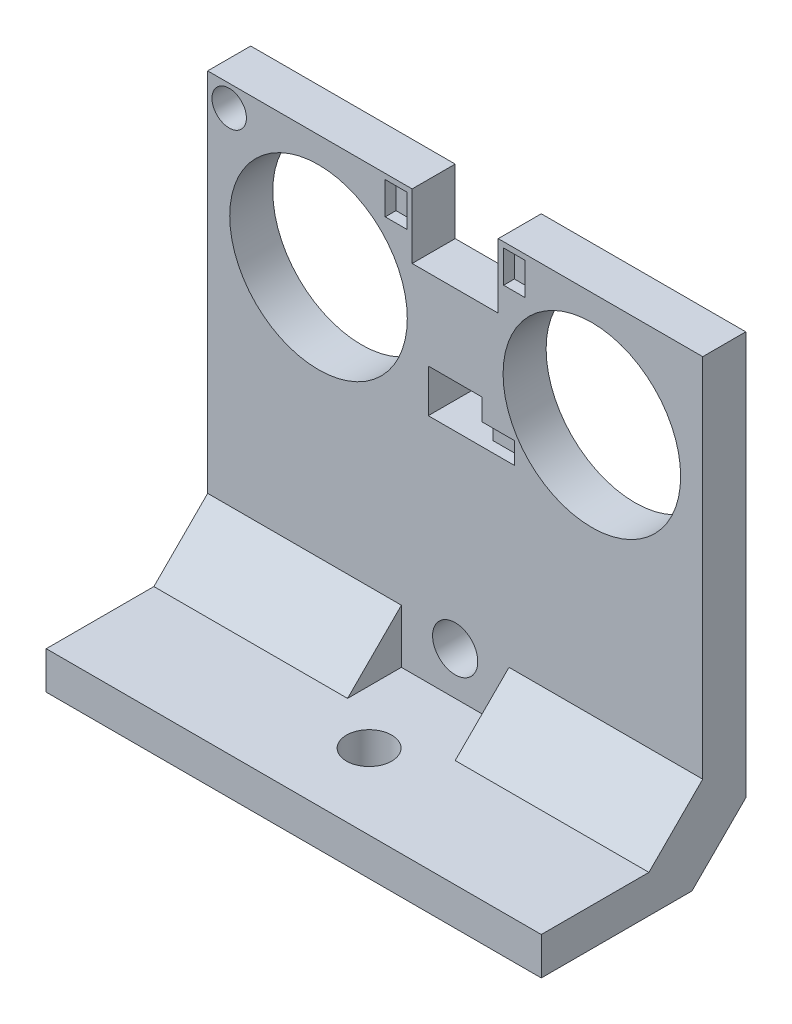
ISO-10303-21;
HEADER;
FILE_DESCRIPTION(('STEP AP214'),'2;1');
FILE_NAME('part.step','',(''),(''),'','','');
FILE_SCHEMA(('AUTOMOTIVE_DESIGN { 1 0 10303 214 1 1 1 1 }'));
ENDSEC;
DATA;
#1=APPLICATION_CONTEXT('core data for automotive mechanical design processes');
#2=APPLICATION_PROTOCOL_DEFINITION('international standard','automotive_design',2000,#1);
#3=PRODUCT_CONTEXT('',#1,'mechanical');
#4=PRODUCT('Part','Part','',(#3));
#5=PRODUCT_RELATED_PRODUCT_CATEGORY('part','',(#4));
#6=PRODUCT_DEFINITION_FORMATION('','',#4);
#7=PRODUCT_DEFINITION_CONTEXT('part definition',#1,'design');
#8=PRODUCT_DEFINITION('design','',#6,#7);
#9=PRODUCT_DEFINITION_SHAPE('','',#8);
#10=(LENGTH_UNIT() NAMED_UNIT(*) SI_UNIT(.MILLI.,.METRE.));
#11=(NAMED_UNIT(*) PLANE_ANGLE_UNIT() SI_UNIT($,.RADIAN.));
#12=(NAMED_UNIT(*) SI_UNIT($,.STERADIAN.) SOLID_ANGLE_UNIT());
#13=UNCERTAINTY_MEASURE_WITH_UNIT(LENGTH_MEASURE(1.E-05),#10,'distance_accuracy_value','');
#14=(GEOMETRIC_REPRESENTATION_CONTEXT(3) GLOBAL_UNCERTAINTY_ASSIGNED_CONTEXT((#13)) GLOBAL_UNIT_ASSIGNED_CONTEXT((#10,
#11,#12)) REPRESENTATION_CONTEXT('',''));
#15=CARTESIAN_POINT('',(0.,0.,0.));
#16=DIRECTION('',(0.,0.,1.));
#17=DIRECTION('',(1.,0.,0.));
#18=AXIS2_PLACEMENT_3D('',#15,#16,#17);
#19=CARTESIAN_POINT('',(23.,-29.,9.00000000000004));
#20=DIRECTION('',(0.,-0.707106781186552,-0.707106781186544));
#21=DIRECTION('',(-1.,0.,0.));
#22=AXIS2_PLACEMENT_3D('',#19,#20,#21);
#23=PLANE('',#22);
#24=DIRECTION('',(0.,0.707106781186544,-0.707106781186551));
#25=VECTOR('',#24,1.);
#26=CARTESIAN_POINT('',(5.,-29.,9.00000000000004));
#27=LINE('',#26,#25);
#28=CARTESIAN_POINT('',(5.,-29.,9.00000000000004));
#29=VERTEX_POINT('',#28);
#30=CARTESIAN_POINT('',(5.,-24.,4.));
#31=VERTEX_POINT('',#30);
#32=EDGE_CURVE('E12',#29,#31,#27,.T.);
#33=ORIENTED_EDGE('',*,*,#32,.F.);
#34=DIRECTION('',(-1.,0.,0.));
#35=VECTOR('',#34,1.);
#36=CARTESIAN_POINT('',(23.,-29.,9.00000000000004));
#37=LINE('',#36,#35);
#38=CARTESIAN_POINT('',(23.,-29.,9.00000000000004));
#39=VERTEX_POINT('',#38);
#40=EDGE_CURVE('E483',#39,#29,#37,.T.);
#41=ORIENTED_EDGE('',*,*,#40,.F.);
#42=DIRECTION('',(0.,-0.707106781186544,0.707106781186551));
#43=VECTOR('',#42,1.);
#44=CARTESIAN_POINT('',(23.,-17.0000000000001,-3.00000000000001));
#45=LINE('',#44,#43);
#46=CARTESIAN_POINT('',(23.,-24.,4.));
#47=VERTEX_POINT('',#46);
#48=EDGE_CURVE('E488',#47,#39,#45,.T.);
#49=ORIENTED_EDGE('',*,*,#48,.F.);
#50=DIRECTION('',(1.,0.,0.));
#51=VECTOR('',#50,1.);
#52=CARTESIAN_POINT('',(0.,-24.,4.));
#53=LINE('',#52,#51);
#54=EDGE_CURVE('E485',#31,#47,#53,.T.);
#55=ORIENTED_EDGE('',*,*,#54,.F.);
#56=EDGE_LOOP('',(#33,#41,#49,#55));
#57=FACE_BOUND('',#56,.T.);
#58=ADVANCED_FACE('F36',(#57),#23,.F.);
#59=DIRECTION('',(0.,-0.707106781186544,0.707106781186551));
#60=VECTOR('',#59,1.);
#61=CARTESIAN_POINT('',(-5.,-29.,9.00000000000004));
#62=LINE('',#61,#60);
#63=CARTESIAN_POINT('',(-5.,-24.,4.));
#64=VERTEX_POINT('',#63);
#65=CARTESIAN_POINT('',(-5.,-29.,9.00000000000004));
#66=VERTEX_POINT('',#65);
#67=EDGE_CURVE('E44',#64,#66,#62,.T.);
#68=ORIENTED_EDGE('',*,*,#67,.F.);
#69=CARTESIAN_POINT('',(-23.,-24.,4.));
#70=VERTEX_POINT('',#69);
#71=EDGE_CURVE('E251',#70,#64,#53,.T.);
#72=ORIENTED_EDGE('',*,*,#71,.F.);
#73=DIRECTION('',(0.,0.707106781186544,-0.707106781186551));
#74=VECTOR('',#73,1.);
#75=CARTESIAN_POINT('',(-23.,-17.0000000000001,-3.00000000000001));
#76=LINE('',#75,#74);
#77=CARTESIAN_POINT('',(-23.,-29.,9.00000000000004));
#78=VERTEX_POINT('',#77);
#79=EDGE_CURVE('E51',#78,#70,#76,.T.);
#80=ORIENTED_EDGE('',*,*,#79,.F.);
#81=EDGE_CURVE('E59',#66,#78,#37,.T.);
#82=ORIENTED_EDGE('',*,*,#81,.F.);
#83=EDGE_LOOP('',(#68,#72,#80,#82));
#84=FACE_BOUND('',#83,.T.);
#85=ADVANCED_FACE('F523',(#84),#23,.F.);
#86=CARTESIAN_POINT('',(0.,-25.,19.));
#87=DIRECTION('',(0.,0.,-1.));
#88=DIRECTION('',(-1.,0.,0.));
#89=AXIS2_PLACEMENT_3D('',#86,#87,#88);
#90=CYLINDRICAL_SURFACE('',#89,2.1);
#91=CARTESIAN_POINT('',(0.,-25.,0.));
#92=DIRECTION('',(0.,0.,-1.));
#93=DIRECTION('',(-1.,0.,0.));
#94=AXIS2_PLACEMENT_3D('',#91,#92,#93);
#95=CIRCLE('',#94,2.1);
#96=CARTESIAN_POINT('',(-2.1,-25.,0.));
#97=VERTEX_POINT('',#96);
#98=EDGE_CURVE('E239',#97,#97,#95,.T.);
#99=ORIENTED_EDGE('',*,*,#98,.T.);
#100=EDGE_LOOP('',(#99));
#101=FACE_BOUND('',#100,.T.);
#102=CARTESIAN_POINT('',(0.,-25.,4.));
#103=DIRECTION('',(0.,0.,-1.));
#104=DIRECTION('',(-1.,0.,0.));
#105=AXIS2_PLACEMENT_3D('',#102,#103,#104);
#106=CIRCLE('',#105,2.1);
#107=CARTESIAN_POINT('',(-2.1,-25.,4.));
#108=VERTEX_POINT('',#107);
#109=EDGE_CURVE('E263',#108,#108,#106,.T.);
#110=ORIENTED_EDGE('',*,*,#109,.F.);
#111=EDGE_LOOP('',(#110));
#112=FACE_BOUND('',#111,.T.);
#113=ADVANCED_FACE('F514',(#101,#112),#90,.F.);
#114=CARTESIAN_POINT('',(0.,0.,4.));
#115=DIRECTION('',(0.,0.,-1.));
#116=DIRECTION('',(-1.,0.,0.));
#117=AXIS2_PLACEMENT_3D('',#114,#115,#116);
#118=PLANE('',#117);
#119=CARTESIAN_POINT('',(-21.,8.,4.));
#120=DIRECTION('',(0.,0.,1.));
#121=DIRECTION('',(1.,0.,0.));
#122=AXIS2_PLACEMENT_3D('',#119,#120,#121);
#123=CIRCLE('',#122,1.6);
#124=CARTESIAN_POINT('',(-19.4,8.,4.));
#125=VERTEX_POINT('',#124);
#126=EDGE_CURVE('E505',#125,#125,#123,.T.);
#127=ORIENTED_EDGE('',*,*,#126,.F.);
#128=EDGE_LOOP('',(#127));
#129=FACE_BOUND('',#128,.T.);
#130=DIRECTION('',(0.,1.,0.));
#131=VECTOR('',#130,1.);
#132=CARTESIAN_POINT('',(5.,-21.,4.));
#133=LINE('',#132,#131);
#134=CARTESIAN_POINT('',(5.,-29.,4.));
#135=VERTEX_POINT('',#134);
#136=EDGE_CURVE('E252',#135,#31,#133,.T.);
#137=ORIENTED_EDGE('',*,*,#136,.T.);
#138=ORIENTED_EDGE('',*,*,#54,.T.);
#139=DIRECTION('',(0.,1.,0.));
#140=VECTOR('',#139,1.);
#141=CARTESIAN_POINT('',(23.,-10.,4.));
#142=LINE('',#141,#140);
#143=CARTESIAN_POINT('',(23.,10.,4.));
#144=VERTEX_POINT('',#143);
#145=EDGE_CURVE('E452',#47,#144,#142,.T.);
#146=ORIENTED_EDGE('',*,*,#145,.T.);
#147=DIRECTION('',(-1.,0.,0.));
#148=VECTOR('',#147,1.);
#149=CARTESIAN_POINT('',(-23.,10.,4.));
#150=LINE('',#149,#148);
#151=CARTESIAN_POINT('',(4.00000000000001,10.,4.));
#152=VERTEX_POINT('',#151);
#153=EDGE_CURVE('E456',#144,#152,#150,.T.);
#154=ORIENTED_EDGE('',*,*,#153,.T.);
#155=DIRECTION('',(0.,1.,0.));
#156=VECTOR('',#155,1.);
#157=CARTESIAN_POINT('',(4.00000000000001,4.,4.));
#158=LINE('',#157,#156);
#159=CARTESIAN_POINT('',(4.00000000000001,4.,4.));
#160=VERTEX_POINT('',#159);
#161=EDGE_CURVE('E407',#160,#152,#158,.T.);
#162=ORIENTED_EDGE('',*,*,#161,.F.);
#163=DIRECTION('',(1.,0.,0.));
#164=VECTOR('',#163,1.);
#165=CARTESIAN_POINT('',(-3.99999999999999,4.,4.));
#166=LINE('',#165,#164);
#167=CARTESIAN_POINT('',(-3.99999999999999,4.,4.));
#168=VERTEX_POINT('',#167);
#169=EDGE_CURVE('E418',#168,#160,#166,.T.);
#170=ORIENTED_EDGE('',*,*,#169,.F.);
#171=DIRECTION('',(0.,-1.,0.));
#172=VECTOR('',#171,1.);
#173=CARTESIAN_POINT('',(-3.99999999999999,4.,4.));
#174=LINE('',#173,#172);
#175=CARTESIAN_POINT('',(-3.99999999999999,10.,4.));
#176=VERTEX_POINT('',#175);
#177=EDGE_CURVE('E426',#176,#168,#174,.T.);
#178=ORIENTED_EDGE('',*,*,#177,.F.);
#179=CARTESIAN_POINT('',(-23.,10.,4.));
#180=VERTEX_POINT('',#179);
#181=EDGE_CURVE('E454',#176,#180,#150,.T.);
#182=ORIENTED_EDGE('',*,*,#181,.T.);
#183=DIRECTION('',(0.,-1.,0.));
#184=VECTOR('',#183,1.);
#185=CARTESIAN_POINT('',(-23.,-10.,4.));
#186=LINE('',#185,#184);
#187=EDGE_CURVE('E459',#180,#70,#186,.T.);
#188=ORIENTED_EDGE('',*,*,#187,.T.);
#189=ORIENTED_EDGE('',*,*,#71,.T.);
#190=DIRECTION('',(0.,-1.,0.));
#191=VECTOR('',#190,1.);
#192=CARTESIAN_POINT('',(-5.,-21.,4.));
#193=LINE('',#192,#191);
#194=CARTESIAN_POINT('',(-5.,-29.,4.));
#195=VERTEX_POINT('',#194);
#196=EDGE_CURVE('E236',#64,#195,#193,.T.);
#197=ORIENTED_EDGE('',*,*,#196,.T.);
#198=DIRECTION('',(1.,0.,0.));
#199=VECTOR('',#198,1.);
#200=CARTESIAN_POINT('',(-5.,-29.,4.));
#201=LINE('',#200,#199);
#202=EDGE_CURVE('E248',#195,#135,#201,.T.);
#203=ORIENTED_EDGE('',*,*,#202,.T.);
#204=EDGE_LOOP('',(#137,#138,#146,#154,#162,#170,#178,#182,#188,#189,#197,#203));
#205=FACE_BOUND('',#204,.T.);
#206=ORIENTED_EDGE('',*,*,#109,.T.);
#207=EDGE_LOOP('',(#206));
#208=FACE_BOUND('',#207,.T.);
#209=DIRECTION('',(1.,0.,0.));
#210=VECTOR('',#209,1.);
#211=CARTESIAN_POINT('',(-4.5,6.5,4.));
#212=LINE('',#211,#210);
#213=CARTESIAN_POINT('',(-6.5,6.5,4.));
#214=VERTEX_POINT('',#213);
#215=CARTESIAN_POINT('',(-4.5,6.5,4.));
#216=VERTEX_POINT('',#215);
#217=EDGE_CURVE('E336',#214,#216,#212,.T.);
#218=ORIENTED_EDGE('',*,*,#217,.F.);
#219=DIRECTION('',(0.,-1.,0.));
#220=VECTOR('',#219,1.);
#221=CARTESIAN_POINT('',(-6.5,9.5,4.));
#222=LINE('',#221,#220);
#223=CARTESIAN_POINT('',(-6.5,9.5,4.));
#224=VERTEX_POINT('',#223);
#225=EDGE_CURVE('E334',#224,#214,#222,.T.);
#226=ORIENTED_EDGE('',*,*,#225,.F.);
#227=DIRECTION('',(-1.,0.,0.));
#228=VECTOR('',#227,1.);
#229=CARTESIAN_POINT('',(-4.5,9.5,4.));
#230=LINE('',#229,#228);
#231=CARTESIAN_POINT('',(-4.5,9.5,4.));
#232=VERTEX_POINT('',#231);
#233=EDGE_CURVE('E324',#232,#224,#230,.T.);
#234=ORIENTED_EDGE('',*,*,#233,.F.);
#235=DIRECTION('',(0.,1.,0.));
#236=VECTOR('',#235,1.);
#237=CARTESIAN_POINT('',(-4.5,9.5,4.));
#238=LINE('',#237,#236);
#239=EDGE_CURVE('E340',#216,#232,#238,.T.);
#240=ORIENTED_EDGE('',*,*,#239,.F.);
#241=EDGE_LOOP('',(#218,#226,#234,#240));
#242=FACE_BOUND('',#241,.T.);
#243=DIRECTION('',(1.,0.,0.));
#244=VECTOR('',#243,1.);
#245=CARTESIAN_POINT('',(6.50000000000001,6.5,4.));
#246=LINE('',#245,#244);
#247=CARTESIAN_POINT('',(4.50000000000001,6.5,4.));
#248=VERTEX_POINT('',#247);
#249=CARTESIAN_POINT('',(6.50000000000001,6.5,4.));
#250=VERTEX_POINT('',#249);
#251=EDGE_CURVE('E367',#248,#250,#246,.T.);
#252=ORIENTED_EDGE('',*,*,#251,.F.);
#253=DIRECTION('',(0.,-1.,0.));
#254=VECTOR('',#253,1.);
#255=CARTESIAN_POINT('',(4.50000000000001,9.5,4.));
#256=LINE('',#255,#254);
#257=CARTESIAN_POINT('',(4.50000000000001,9.5,4.));
#258=VERTEX_POINT('',#257);
#259=EDGE_CURVE('E293',#258,#248,#256,.T.);
#260=ORIENTED_EDGE('',*,*,#259,.F.);
#261=DIRECTION('',(-1.,0.,0.));
#262=VECTOR('',#261,1.);
#263=CARTESIAN_POINT('',(6.50000000000001,9.5,4.));
#264=LINE('',#263,#262);
#265=CARTESIAN_POINT('',(6.50000000000001,9.5,4.));
#266=VERTEX_POINT('',#265);
#267=EDGE_CURVE('E356',#266,#258,#264,.T.);
#268=ORIENTED_EDGE('',*,*,#267,.F.);
#269=DIRECTION('',(0.,1.,0.));
#270=VECTOR('',#269,1.);
#271=CARTESIAN_POINT('',(6.50000000000001,9.5,4.));
#272=LINE('',#271,#270);
#273=EDGE_CURVE('E370',#250,#266,#272,.T.);
#274=ORIENTED_EDGE('',*,*,#273,.F.);
#275=EDGE_LOOP('',(#252,#260,#268,#274));
#276=FACE_BOUND('',#275,.T.);
#277=DIRECTION('',(0.,1.,0.));
#278=VECTOR('',#277,1.);
#279=CARTESIAN_POINT('',(2.5,-3.5,4.));
#280=LINE('',#279,#278);
#281=CARTESIAN_POINT('',(2.5,-5.5,4.));
#282=VERTEX_POINT('',#281);
#283=CARTESIAN_POINT('',(2.5,-3.5,4.));
#284=VERTEX_POINT('',#283);
#285=EDGE_CURVE('E315',#282,#284,#280,.T.);
#286=ORIENTED_EDGE('',*,*,#285,.F.);
#287=DIRECTION('',(-1.,0.,0.));
#288=VECTOR('',#287,1.);
#289=CARTESIAN_POINT('',(2.5,-5.5,4.));
#290=LINE('',#289,#288);
#291=CARTESIAN_POINT('',(5.5,-5.5,4.));
#292=VERTEX_POINT('',#291);
#293=EDGE_CURVE('E297',#292,#282,#290,.T.);
#294=ORIENTED_EDGE('',*,*,#293,.F.);
#295=DIRECTION('',(0.,1.,0.));
#296=VECTOR('',#295,1.);
#297=CARTESIAN_POINT('',(5.5,-7.5,4.));
#298=LINE('',#297,#296);
#299=CARTESIAN_POINT('',(5.5,-7.5,4.));
#300=VERTEX_POINT('',#299);
#301=EDGE_CURVE('E307',#300,#292,#298,.T.);
#302=ORIENTED_EDGE('',*,*,#301,.F.);
#303=DIRECTION('',(1.,0.,0.));
#304=VECTOR('',#303,1.);
#305=CARTESIAN_POINT('',(-2.5,-7.5,4.));
#306=LINE('',#305,#304);
#307=CARTESIAN_POINT('',(-2.5,-7.5,4.));
#308=VERTEX_POINT('',#307);
#309=EDGE_CURVE('E386',#308,#300,#306,.T.);
#310=ORIENTED_EDGE('',*,*,#309,.F.);
#311=DIRECTION('',(0.,-1.,0.));
#312=VECTOR('',#311,1.);
#313=CARTESIAN_POINT('',(-2.5,-3.5,4.));
#314=LINE('',#313,#312);
#315=CARTESIAN_POINT('',(-2.5,-3.5,4.));
#316=VERTEX_POINT('',#315);
#317=EDGE_CURVE('E400',#316,#308,#314,.T.);
#318=ORIENTED_EDGE('',*,*,#317,.F.);
#319=DIRECTION('',(-1.,0.,0.));
#320=VECTOR('',#319,1.);
#321=CARTESIAN_POINT('',(-2.5,-3.5,4.));
#322=LINE('',#321,#320);
#323=EDGE_CURVE('E397',#284,#316,#322,.T.);
#324=ORIENTED_EDGE('',*,*,#323,.F.);
#325=EDGE_LOOP('',(#286,#294,#302,#310,#318,#324));
#326=FACE_BOUND('',#325,.T.);
#327=CARTESIAN_POINT('',(-12.7,-0.650000000000001,4.));
#328=DIRECTION('',(0.,0.,1.));
#329=DIRECTION('',(1.,0.,0.));
#330=AXIS2_PLACEMENT_3D('',#327,#328,#329);
#331=CIRCLE('',#330,8.25);
#332=CARTESIAN_POINT('',(-4.45,-0.650000000000001,4.));
#333=VERTEX_POINT('',#332);
#334=EDGE_CURVE('E444',#333,#333,#331,.T.);
#335=ORIENTED_EDGE('',*,*,#334,.F.);
#336=EDGE_LOOP('',(#335));
#337=FACE_BOUND('',#336,.T.);
#338=CARTESIAN_POINT('',(12.7,-0.650000000000001,4.));
#339=DIRECTION('',(0.,0.,1.));
#340=DIRECTION('',(1.,0.,0.));
#341=AXIS2_PLACEMENT_3D('',#338,#339,#340);
#342=CIRCLE('',#341,8.25);
#343=CARTESIAN_POINT('',(20.95,-0.650000000000001,4.));
#344=VERTEX_POINT('',#343);
#345=EDGE_CURVE('E433',#344,#344,#342,.T.);
#346=ORIENTED_EDGE('',*,*,#345,.F.);
#347=EDGE_LOOP('',(#346));
#348=FACE_BOUND('',#347,.T.);
#349=ADVANCED_FACE('F246',(#129,#205,#208,#242,#276,#326,#337,#348),#118,.F.);
#350=CARTESIAN_POINT('',(-23.,10.,4.));
#351=DIRECTION('',(0.,-1.,0.));
#352=DIRECTION('',(0.,0.,-1.));
#353=AXIS2_PLACEMENT_3D('',#350,#351,#352);
#354=PLANE('',#353);
#355=DIRECTION('',(-1.,0.,0.));
#356=VECTOR('',#355,1.);
#357=CARTESIAN_POINT('',(-23.,10.,0.));
#358=LINE('',#357,#356);
#359=CARTESIAN_POINT('',(23.,10.,0.));
#360=VERTEX_POINT('',#359);
#361=CARTESIAN_POINT('',(4.00000000000001,10.,0.));
#362=VERTEX_POINT('',#361);
#363=EDGE_CURVE('E464',#360,#362,#358,.T.);
#364=ORIENTED_EDGE('',*,*,#363,.T.);
#365=DIRECTION('',(0.,0.,1.));
#366=VECTOR('',#365,1.);
#367=CARTESIAN_POINT('',(4.00000000000001,10.,0.));
#368=LINE('',#367,#366);
#369=EDGE_CURVE('E424',#362,#152,#368,.T.);
#370=ORIENTED_EDGE('',*,*,#369,.T.);
#371=ORIENTED_EDGE('',*,*,#153,.F.);
#372=DIRECTION('',(0.,0.,-1.));
#373=VECTOR('',#372,1.);
#374=CARTESIAN_POINT('',(23.,10.,4.));
#375=LINE('',#374,#373);
#376=EDGE_CURVE('E471',#144,#360,#375,.T.);
#377=ORIENTED_EDGE('',*,*,#376,.T.);
#378=EDGE_LOOP('',(#364,#370,#371,#377));
#379=FACE_BOUND('',#378,.T.);
#380=ADVANCED_FACE('F513',(#379),#354,.F.);
#381=CARTESIAN_POINT('',(23.,-10.,4.));
#382=DIRECTION('',(-1.,0.,0.));
#383=DIRECTION('',(0.,0.,1.));
#384=AXIS2_PLACEMENT_3D('',#381,#382,#383);
#385=PLANE('',#384);
#386=DIRECTION('',(0.,0.,1.));
#387=VECTOR('',#386,1.);
#388=CARTESIAN_POINT('',(23.,-32.5,4.));
#389=LINE('',#388,#387);
#390=CARTESIAN_POINT('',(23.,-32.5,5.));
#391=VERTEX_POINT('',#390);
#392=CARTESIAN_POINT('',(23.,-32.5,19.));
#393=VERTEX_POINT('',#392);
#394=EDGE_CURVE('E291',#391,#393,#389,.T.);
#395=ORIENTED_EDGE('',*,*,#394,.F.);
#396=DIRECTION('',(0.,-0.707106781186549,0.707106781186546));
#397=VECTOR('',#396,1.);
#398=CARTESIAN_POINT('',(23.,-32.5,5.));
#399=LINE('',#398,#397);
#400=CARTESIAN_POINT('',(23.,-27.5,0.));
#401=VERTEX_POINT('',#400);
#402=EDGE_CURVE('E477',#391,#401,#399,.F.);
#403=ORIENTED_EDGE('',*,*,#402,.T.);
#404=DIRECTION('',(0.,1.,0.));
#405=VECTOR('',#404,1.);
#406=CARTESIAN_POINT('',(23.,-10.,0.));
#407=LINE('',#406,#405);
#408=EDGE_CURVE('E443',#401,#360,#407,.T.);
#409=ORIENTED_EDGE('',*,*,#408,.T.);
#410=ORIENTED_EDGE('',*,*,#376,.F.);
#411=ORIENTED_EDGE('',*,*,#145,.F.);
#412=ORIENTED_EDGE('',*,*,#48,.T.);
#413=DIRECTION('',(0.,0.,-1.));
#414=VECTOR('',#413,1.);
#415=CARTESIAN_POINT('',(23.,-29.,19.));
#416=LINE('',#415,#414);
#417=CARTESIAN_POINT('',(23.,-29.,19.));
#418=VERTEX_POINT('',#417);
#419=EDGE_CURVE('E276',#418,#39,#416,.T.);
#420=ORIENTED_EDGE('',*,*,#419,.F.);
#421=DIRECTION('',(0.,1.,0.));
#422=VECTOR('',#421,1.);
#423=CARTESIAN_POINT('',(23.,-32.5,19.));
#424=LINE('',#423,#422);
#425=EDGE_CURVE('E273',#393,#418,#424,.T.);
#426=ORIENTED_EDGE('',*,*,#425,.F.);
#427=EDGE_LOOP('',(#395,#403,#409,#410,#411,#412,#420,#426));
#428=FACE_BOUND('',#427,.T.);
#429=ADVANCED_FACE('F495',(#428),#385,.F.);
#430=ORIENTED_EDGE('',*,*,#181,.F.);
#431=DIRECTION('',(0.,0.,1.));
#432=VECTOR('',#431,1.);
#433=CARTESIAN_POINT('',(-3.99999999999999,10.,0.));
#434=LINE('',#433,#432);
#435=CARTESIAN_POINT('',(-3.99999999999999,10.,0.));
#436=VERTEX_POINT('',#435);
#437=EDGE_CURVE('E436',#436,#176,#434,.T.);
#438=ORIENTED_EDGE('',*,*,#437,.F.);
#439=CARTESIAN_POINT('',(-23.,10.,0.));
#440=VERTEX_POINT('',#439);
#441=EDGE_CURVE('E463',#436,#440,#358,.T.);
#442=ORIENTED_EDGE('',*,*,#441,.T.);
#443=DIRECTION('',(0.,0.,-1.));
#444=VECTOR('',#443,1.);
#445=CARTESIAN_POINT('',(-23.,10.,4.));
#446=LINE('',#445,#444);
#447=EDGE_CURVE('E461',#180,#440,#446,.T.);
#448=ORIENTED_EDGE('',*,*,#447,.F.);
#449=EDGE_LOOP('',(#430,#438,#442,#448));
#450=FACE_BOUND('',#449,.T.);
#451=ADVANCED_FACE('F522',(#450),#354,.F.);
#452=CARTESIAN_POINT('',(-23.,-10.,4.));
#453=DIRECTION('',(1.,0.,0.));
#454=DIRECTION('',(0.,0.,-1.));
#455=AXIS2_PLACEMENT_3D('',#452,#453,#454);
#456=PLANE('',#455);
#457=DIRECTION('',(0.,-1.,0.));
#458=VECTOR('',#457,1.);
#459=CARTESIAN_POINT('',(-23.,-10.,0.));
#460=LINE('',#459,#458);
#461=CARTESIAN_POINT('',(-23.,-27.5,0.));
#462=VERTEX_POINT('',#461);
#463=EDGE_CURVE('E455',#440,#462,#460,.T.);
#464=ORIENTED_EDGE('',*,*,#463,.T.);
#465=DIRECTION('',(0.,0.707106781186549,-0.707106781186546));
#466=VECTOR('',#465,1.);
#467=CARTESIAN_POINT('',(-23.,-32.5,5.));
#468=LINE('',#467,#466);
#469=CARTESIAN_POINT('',(-23.,-32.5,5.));
#470=VERTEX_POINT('',#469);
#471=EDGE_CURVE('E481',#462,#470,#468,.F.);
#472=ORIENTED_EDGE('',*,*,#471,.T.);
#473=DIRECTION('',(0.,0.,-1.));
#474=VECTOR('',#473,1.);
#475=CARTESIAN_POINT('',(-23.,-32.5,4.));
#476=LINE('',#475,#474);
#477=CARTESIAN_POINT('',(-23.,-32.5,19.));
#478=VERTEX_POINT('',#477);
#479=EDGE_CURVE('E286',#478,#470,#476,.T.);
#480=ORIENTED_EDGE('',*,*,#479,.F.);
#481=DIRECTION('',(0.,1.,0.));
#482=VECTOR('',#481,1.);
#483=CARTESIAN_POINT('',(-23.,-32.5,19.));
#484=LINE('',#483,#482);
#485=CARTESIAN_POINT('',(-23.,-29.,19.));
#486=VERTEX_POINT('',#485);
#487=EDGE_CURVE('E270',#478,#486,#484,.T.);
#488=ORIENTED_EDGE('',*,*,#487,.T.);
#489=DIRECTION('',(0.,0.,-1.));
#490=VECTOR('',#489,1.);
#491=CARTESIAN_POINT('',(-23.,-29.,19.));
#492=LINE('',#491,#490);
#493=EDGE_CURVE('E277',#486,#78,#492,.T.);
#494=ORIENTED_EDGE('',*,*,#493,.T.);
#495=ORIENTED_EDGE('',*,*,#79,.T.);
#496=ORIENTED_EDGE('',*,*,#187,.F.);
#497=ORIENTED_EDGE('',*,*,#447,.T.);
#498=EDGE_LOOP('',(#464,#472,#480,#488,#494,#495,#496,#497));
#499=FACE_BOUND('',#498,.T.);
#500=ADVANCED_FACE('F535',(#499),#456,.F.);
#501=CARTESIAN_POINT('',(0.,0.,0.));
#502=DIRECTION('',(0.,0.,-1.));
#503=DIRECTION('',(-1.,0.,0.));
#504=AXIS2_PLACEMENT_3D('',#501,#502,#503);
#505=PLANE('',#504);
#506=CARTESIAN_POINT('',(-21.,8.,0.));
#507=DIRECTION('',(0.,0.,-1.));
#508=DIRECTION('',(-1.,0.,0.));
#509=AXIS2_PLACEMENT_3D('',#506,#507,#508);
#510=CIRCLE('',#509,1.6);
#511=CARTESIAN_POINT('',(-22.6,8.,0.));
#512=VERTEX_POINT('',#511);
#513=EDGE_CURVE('E39',#512,#512,#510,.T.);
#514=ORIENTED_EDGE('',*,*,#513,.F.);
#515=EDGE_LOOP('',(#514));
#516=FACE_BOUND('',#515,.T.);
#517=ORIENTED_EDGE('',*,*,#98,.F.);
#518=EDGE_LOOP('',(#517));
#519=FACE_BOUND('',#518,.T.);
#520=DIRECTION('',(0.,1.,0.));
#521=VECTOR('',#520,1.);
#522=CARTESIAN_POINT('',(2.5,-3.5,0.));
#523=LINE('',#522,#521);
#524=CARTESIAN_POINT('',(2.5,-7.5,0.));
#525=VERTEX_POINT('',#524);
#526=CARTESIAN_POINT('',(2.5,-3.5,0.));
#527=VERTEX_POINT('',#526);
#528=EDGE_CURVE('E382',#525,#527,#523,.T.);
#529=ORIENTED_EDGE('',*,*,#528,.T.);
#530=DIRECTION('',(-1.,0.,0.));
#531=VECTOR('',#530,1.);
#532=CARTESIAN_POINT('',(-2.5,-3.5,0.));
#533=LINE('',#532,#531);
#534=CARTESIAN_POINT('',(-2.5,-3.5,0.));
#535=VERTEX_POINT('',#534);
#536=EDGE_CURVE('E385',#527,#535,#533,.T.);
#537=ORIENTED_EDGE('',*,*,#536,.T.);
#538=DIRECTION('',(0.,-1.,0.));
#539=VECTOR('',#538,1.);
#540=CARTESIAN_POINT('',(-2.5,-3.5,0.));
#541=LINE('',#540,#539);
#542=CARTESIAN_POINT('',(-2.5,-7.5,0.));
#543=VERTEX_POINT('',#542);
#544=EDGE_CURVE('E389',#535,#543,#541,.T.);
#545=ORIENTED_EDGE('',*,*,#544,.T.);
#546=DIRECTION('',(1.,0.,0.));
#547=VECTOR('',#546,1.);
#548=CARTESIAN_POINT('',(-2.5,-7.5,0.));
#549=LINE('',#548,#547);
#550=EDGE_CURVE('E392',#543,#525,#549,.T.);
#551=ORIENTED_EDGE('',*,*,#550,.T.);
#552=EDGE_LOOP('',(#529,#537,#545,#551));
#553=FACE_BOUND('',#552,.T.);
#554=ORIENTED_EDGE('',*,*,#408,.F.);
#555=DIRECTION('',(-1.,0.,0.));
#556=VECTOR('',#555,1.);
#557=CARTESIAN_POINT('',(0.,-27.5,0.));
#558=LINE('',#557,#556);
#559=EDGE_CURVE('E479',#401,#462,#558,.T.);
#560=ORIENTED_EDGE('',*,*,#559,.T.);
#561=ORIENTED_EDGE('',*,*,#463,.F.);
#562=ORIENTED_EDGE('',*,*,#441,.F.);
#563=DIRECTION('',(0.,-1.,0.));
#564=VECTOR('',#563,1.);
#565=CARTESIAN_POINT('',(-3.99999999999999,4.,0.));
#566=LINE('',#565,#564);
#567=CARTESIAN_POINT('',(-3.99999999999999,4.,0.));
#568=VERTEX_POINT('',#567);
#569=EDGE_CURVE('E417',#436,#568,#566,.T.);
#570=ORIENTED_EDGE('',*,*,#569,.T.);
#571=DIRECTION('',(1.,0.,0.));
#572=VECTOR('',#571,1.);
#573=CARTESIAN_POINT('',(-3.99999999999999,4.,0.));
#574=LINE('',#573,#572);
#575=CARTESIAN_POINT('',(4.00000000000001,4.,0.));
#576=VERTEX_POINT('',#575);
#577=EDGE_CURVE('E421',#568,#576,#574,.T.);
#578=ORIENTED_EDGE('',*,*,#577,.T.);
#579=DIRECTION('',(0.,1.,0.));
#580=VECTOR('',#579,1.);
#581=CARTESIAN_POINT('',(4.00000000000001,4.,0.));
#582=LINE('',#581,#580);
#583=EDGE_CURVE('E414',#576,#362,#582,.T.);
#584=ORIENTED_EDGE('',*,*,#583,.T.);
#585=ORIENTED_EDGE('',*,*,#363,.F.);
#586=EDGE_LOOP('',(#554,#560,#561,#562,#570,#578,#584,#585));
#587=FACE_BOUND('',#586,.T.);
#588=CARTESIAN_POINT('',(-12.7,-0.650000000000001,0.));
#589=DIRECTION('',(0.,0.,1.));
#590=DIRECTION('',(1.,0.,0.));
#591=AXIS2_PLACEMENT_3D('',#588,#589,#590);
#592=CIRCLE('',#591,8.25);
#593=CARTESIAN_POINT('',(-4.45,-0.650000000000001,0.));
#594=VERTEX_POINT('',#593);
#595=EDGE_CURVE('E440',#594,#594,#592,.T.);
#596=ORIENTED_EDGE('',*,*,#595,.T.);
#597=EDGE_LOOP('',(#596));
#598=FACE_BOUND('',#597,.T.);
#599=CARTESIAN_POINT('',(12.7,-0.650000000000001,0.));
#600=DIRECTION('',(0.,0.,1.));
#601=DIRECTION('',(1.,0.,0.));
#602=AXIS2_PLACEMENT_3D('',#599,#600,#601);
#603=CIRCLE('',#602,8.25);
#604=CARTESIAN_POINT('',(20.95,-0.650000000000001,0.));
#605=VERTEX_POINT('',#604);
#606=EDGE_CURVE('E447',#605,#605,#603,.T.);
#607=ORIENTED_EDGE('',*,*,#606,.T.);
#608=EDGE_LOOP('',(#607));
#609=FACE_BOUND('',#608,.T.);
#610=ADVANCED_FACE('F550',(#516,#519,#553,#587,#598,#609),#505,.T.);
#611=CARTESIAN_POINT('',(12.7,-0.650000000000001,0.));
#612=DIRECTION('',(0.,0.,1.));
#613=DIRECTION('',(1.,0.,0.));
#614=AXIS2_PLACEMENT_3D('',#611,#612,#613);
#615=CYLINDRICAL_SURFACE('',#614,8.25);
#616=ORIENTED_EDGE('',*,*,#606,.F.);
#617=EDGE_LOOP('',(#616));
#618=FACE_BOUND('',#617,.T.);
#619=ORIENTED_EDGE('',*,*,#345,.T.);
#620=EDGE_LOOP('',(#619));
#621=FACE_BOUND('',#620,.T.);
#622=ADVANCED_FACE('F578',(#618,#621),#615,.F.);
#623=CARTESIAN_POINT('',(-12.7,-0.650000000000001,0.));
#624=DIRECTION('',(0.,0.,1.));
#625=DIRECTION('',(1.,0.,0.));
#626=AXIS2_PLACEMENT_3D('',#623,#624,#625);
#627=CYLINDRICAL_SURFACE('',#626,8.25);
#628=ORIENTED_EDGE('',*,*,#595,.F.);
#629=EDGE_LOOP('',(#628));
#630=FACE_BOUND('',#629,.T.);
#631=ORIENTED_EDGE('',*,*,#334,.T.);
#632=EDGE_LOOP('',(#631));
#633=FACE_BOUND('',#632,.T.);
#634=ADVANCED_FACE('F571',(#630,#633),#627,.F.);
#635=CARTESIAN_POINT('',(4.00000000000001,4.,0.));
#636=DIRECTION('',(1.,0.,0.));
#637=DIRECTION('',(0.,0.,-1.));
#638=AXIS2_PLACEMENT_3D('',#635,#636,#637);
#639=PLANE('',#638);
#640=ORIENTED_EDGE('',*,*,#161,.T.);
#641=ORIENTED_EDGE('',*,*,#369,.F.);
#642=ORIENTED_EDGE('',*,*,#583,.F.);
#643=DIRECTION('',(0.,0.,1.));
#644=VECTOR('',#643,1.);
#645=CARTESIAN_POINT('',(4.00000000000001,4.,0.));
#646=LINE('',#645,#644);
#647=EDGE_CURVE('E431',#576,#160,#646,.T.);
#648=ORIENTED_EDGE('',*,*,#647,.T.);
#649=EDGE_LOOP('',(#640,#641,#642,#648));
#650=FACE_BOUND('',#649,.T.);
#651=ADVANCED_FACE('F568',(#650),#639,.F.);
#652=CARTESIAN_POINT('',(-3.99999999999999,4.,0.));
#653=DIRECTION('',(0.,-1.,0.));
#654=DIRECTION('',(0.,0.,-1.));
#655=AXIS2_PLACEMENT_3D('',#652,#653,#654);
#656=PLANE('',#655);
#657=ORIENTED_EDGE('',*,*,#169,.T.);
#658=ORIENTED_EDGE('',*,*,#647,.F.);
#659=ORIENTED_EDGE('',*,*,#577,.F.);
#660=DIRECTION('',(0.,0.,1.));
#661=VECTOR('',#660,1.);
#662=CARTESIAN_POINT('',(-3.99999999999999,4.,0.));
#663=LINE('',#662,#661);
#664=EDGE_CURVE('E434',#568,#168,#663,.T.);
#665=ORIENTED_EDGE('',*,*,#664,.T.);
#666=EDGE_LOOP('',(#657,#658,#659,#665));
#667=FACE_BOUND('',#666,.T.);
#668=ADVANCED_FACE('F564',(#667),#656,.F.);
#669=CARTESIAN_POINT('',(-3.99999999999999,4.,0.));
#670=DIRECTION('',(-1.,0.,0.));
#671=DIRECTION('',(0.,0.,1.));
#672=AXIS2_PLACEMENT_3D('',#669,#670,#671);
#673=PLANE('',#672);
#674=ORIENTED_EDGE('',*,*,#177,.T.);
#675=ORIENTED_EDGE('',*,*,#664,.F.);
#676=ORIENTED_EDGE('',*,*,#569,.F.);
#677=ORIENTED_EDGE('',*,*,#437,.T.);
#678=EDGE_LOOP('',(#674,#675,#676,#677));
#679=FACE_BOUND('',#678,.T.);
#680=ADVANCED_FACE('F560',(#679),#673,.F.);
#681=CARTESIAN_POINT('',(2.5,-3.5,0.));
#682=DIRECTION('',(1.,0.,0.));
#683=DIRECTION('',(0.,1.,0.));
#684=AXIS2_PLACEMENT_3D('',#681,#682,#683);
#685=PLANE('',#684);
#686=DIRECTION('',(0.,-1.,0.));
#687=VECTOR('',#686,1.);
#688=CARTESIAN_POINT('',(2.5,-7.5,3.));
#689=LINE('',#688,#687);
#690=CARTESIAN_POINT('',(2.5,-5.5,3.));
#691=VERTEX_POINT('',#690);
#692=CARTESIAN_POINT('',(2.5,-7.5,3.));
#693=VERTEX_POINT('',#692);
#694=EDGE_CURVE('E294',#691,#693,#689,.T.);
#695=ORIENTED_EDGE('',*,*,#694,.F.);
#696=DIRECTION('',(0.,0.,1.));
#697=VECTOR('',#696,1.);
#698=CARTESIAN_POINT('',(2.5,-5.5,3.));
#699=LINE('',#698,#697);
#700=EDGE_CURVE('E312',#691,#282,#699,.T.);
#701=ORIENTED_EDGE('',*,*,#700,.T.);
#702=ORIENTED_EDGE('',*,*,#285,.T.);
#703=DIRECTION('',(0.,0.,1.));
#704=VECTOR('',#703,1.);
#705=CARTESIAN_POINT('',(2.5,-3.5,0.));
#706=LINE('',#705,#704);
#707=EDGE_CURVE('E395',#527,#284,#706,.T.);
#708=ORIENTED_EDGE('',*,*,#707,.F.);
#709=ORIENTED_EDGE('',*,*,#528,.F.);
#710=DIRECTION('',(0.,0.,1.));
#711=VECTOR('',#710,1.);
#712=CARTESIAN_POINT('',(2.5,-7.5,0.));
#713=LINE('',#712,#711);
#714=EDGE_CURVE('E404',#525,#693,#713,.T.);
#715=ORIENTED_EDGE('',*,*,#714,.T.);
#716=EDGE_LOOP('',(#695,#701,#702,#708,#709,#715));
#717=FACE_BOUND('',#716,.T.);
#718=ADVANCED_FACE('F676',(#717),#685,.F.);
#719=CARTESIAN_POINT('',(-2.5,-7.5,0.));
#720=DIRECTION('',(0.,-1.,0.));
#721=DIRECTION('',(0.,0.,-1.));
#722=AXIS2_PLACEMENT_3D('',#719,#720,#721);
#723=PLANE('',#722);
#724=ORIENTED_EDGE('',*,*,#309,.T.);
#725=DIRECTION('',(0.,0.,1.));
#726=VECTOR('',#725,1.);
#727=CARTESIAN_POINT('',(5.5,-7.5,3.));
#728=LINE('',#727,#726);
#729=CARTESIAN_POINT('',(5.5,-7.5,3.));
#730=VERTEX_POINT('',#729);
#731=EDGE_CURVE('E306',#730,#300,#728,.T.);
#732=ORIENTED_EDGE('',*,*,#731,.F.);
#733=DIRECTION('',(1.,0.,0.));
#734=VECTOR('',#733,1.);
#735=CARTESIAN_POINT('',(2.5,-7.5,3.));
#736=LINE('',#735,#734);
#737=EDGE_CURVE('E296',#693,#730,#736,.T.);
#738=ORIENTED_EDGE('',*,*,#737,.F.);
#739=ORIENTED_EDGE('',*,*,#714,.F.);
#740=ORIENTED_EDGE('',*,*,#550,.F.);
#741=DIRECTION('',(0.,0.,1.));
#742=VECTOR('',#741,1.);
#743=CARTESIAN_POINT('',(-2.5,-7.5,0.));
#744=LINE('',#743,#742);
#745=EDGE_CURVE('E408',#543,#308,#744,.T.);
#746=ORIENTED_EDGE('',*,*,#745,.T.);
#747=EDGE_LOOP('',(#724,#732,#738,#739,#740,#746));
#748=FACE_BOUND('',#747,.T.);
#749=ADVANCED_FACE('F672',(#748),#723,.F.);
#750=CARTESIAN_POINT('',(-2.5,-3.5,0.));
#751=DIRECTION('',(-1.,0.,0.));
#752=DIRECTION('',(0.,-1.,0.));
#753=AXIS2_PLACEMENT_3D('',#750,#751,#752);
#754=PLANE('',#753);
#755=ORIENTED_EDGE('',*,*,#317,.T.);
#756=ORIENTED_EDGE('',*,*,#745,.F.);
#757=ORIENTED_EDGE('',*,*,#544,.F.);
#758=DIRECTION('',(0.,0.,1.));
#759=VECTOR('',#758,1.);
#760=CARTESIAN_POINT('',(-2.5,-3.5,0.));
#761=LINE('',#760,#759);
#762=EDGE_CURVE('E410',#535,#316,#761,.T.);
#763=ORIENTED_EDGE('',*,*,#762,.T.);
#764=EDGE_LOOP('',(#755,#756,#757,#763));
#765=FACE_BOUND('',#764,.T.);
#766=ADVANCED_FACE('F675',(#765),#754,.F.);
#767=CARTESIAN_POINT('',(-2.5,-3.5,0.));
#768=DIRECTION('',(0.,1.,0.));
#769=DIRECTION('',(0.,0.,1.));
#770=AXIS2_PLACEMENT_3D('',#767,#768,#769);
#771=PLANE('',#770);
#772=ORIENTED_EDGE('',*,*,#323,.T.);
#773=ORIENTED_EDGE('',*,*,#762,.F.);
#774=ORIENTED_EDGE('',*,*,#536,.F.);
#775=ORIENTED_EDGE('',*,*,#707,.T.);
#776=EDGE_LOOP('',(#772,#773,#774,#775));
#777=FACE_BOUND('',#776,.T.);
#778=ADVANCED_FACE('F629',(#777),#771,.F.);
#779=CARTESIAN_POINT('',(2.5,-5.5,3.));
#780=DIRECTION('',(0.,1.,0.));
#781=DIRECTION('',(0.,0.,1.));
#782=AXIS2_PLACEMENT_3D('',#779,#780,#781);
#783=PLANE('',#782);
#784=ORIENTED_EDGE('',*,*,#293,.T.);
#785=ORIENTED_EDGE('',*,*,#700,.F.);
#786=DIRECTION('',(-1.,0.,0.));
#787=VECTOR('',#786,1.);
#788=CARTESIAN_POINT('',(2.5,-5.5,3.));
#789=LINE('',#788,#787);
#790=CARTESIAN_POINT('',(5.5,-5.5,3.));
#791=VERTEX_POINT('',#790);
#792=EDGE_CURVE('E303',#791,#691,#789,.T.);
#793=ORIENTED_EDGE('',*,*,#792,.F.);
#794=DIRECTION('',(0.,0.,1.));
#795=VECTOR('',#794,1.);
#796=CARTESIAN_POINT('',(5.5,-5.5,3.));
#797=LINE('',#796,#795);
#798=EDGE_CURVE('E316',#791,#292,#797,.T.);
#799=ORIENTED_EDGE('',*,*,#798,.T.);
#800=EDGE_LOOP('',(#784,#785,#793,#799));
#801=FACE_BOUND('',#800,.T.);
#802=ADVANCED_FACE('F626',(#801),#783,.F.);
#803=CARTESIAN_POINT('',(5.5,-7.5,3.));
#804=DIRECTION('',(1.,0.,0.));
#805=DIRECTION('',(0.,0.,-1.));
#806=AXIS2_PLACEMENT_3D('',#803,#804,#805);
#807=PLANE('',#806);
#808=ORIENTED_EDGE('',*,*,#301,.T.);
#809=ORIENTED_EDGE('',*,*,#798,.F.);
#810=DIRECTION('',(0.,1.,0.));
#811=VECTOR('',#810,1.);
#812=CARTESIAN_POINT('',(5.5,-7.5,3.));
#813=LINE('',#812,#811);
#814=EDGE_CURVE('E300',#730,#791,#813,.T.);
#815=ORIENTED_EDGE('',*,*,#814,.F.);
#816=ORIENTED_EDGE('',*,*,#731,.T.);
#817=EDGE_LOOP('',(#808,#809,#815,#816));
#818=FACE_BOUND('',#817,.T.);
#819=ADVANCED_FACE('F624',(#818),#807,.F.);
#820=CARTESIAN_POINT('',(0.,0.,3.));
#821=DIRECTION('',(0.,0.,-1.));
#822=DIRECTION('',(-1.,0.,0.));
#823=AXIS2_PLACEMENT_3D('',#820,#821,#822);
#824=PLANE('',#823);
#825=ORIENTED_EDGE('',*,*,#694,.T.);
#826=ORIENTED_EDGE('',*,*,#737,.T.);
#827=ORIENTED_EDGE('',*,*,#814,.T.);
#828=ORIENTED_EDGE('',*,*,#792,.T.);
#829=EDGE_LOOP('',(#825,#826,#827,#828));
#830=FACE_BOUND('',#829,.T.);
#831=ADVANCED_FACE('F620',(#830),#824,.F.);
#832=CARTESIAN_POINT('',(4.50000000000001,9.5,3.));
#833=DIRECTION('',(-1.,0.,0.));
#834=DIRECTION('',(0.,0.,1.));
#835=AXIS2_PLACEMENT_3D('',#832,#833,#834);
#836=PLANE('',#835);
#837=ORIENTED_EDGE('',*,*,#259,.T.);
#838=DIRECTION('',(0.,0.,1.));
#839=VECTOR('',#838,1.);
#840=CARTESIAN_POINT('',(4.50000000000001,6.5,3.));
#841=LINE('',#840,#839);
#842=CARTESIAN_POINT('',(4.50000000000001,6.5,3.));
#843=VERTEX_POINT('',#842);
#844=EDGE_CURVE('E365',#843,#248,#841,.T.);
#845=ORIENTED_EDGE('',*,*,#844,.F.);
#846=DIRECTION('',(0.,-1.,0.));
#847=VECTOR('',#846,1.);
#848=CARTESIAN_POINT('',(4.50000000000001,9.5,3.));
#849=LINE('',#848,#847);
#850=CARTESIAN_POINT('',(4.50000000000001,9.5,3.));
#851=VERTEX_POINT('',#850);
#852=EDGE_CURVE('E352',#851,#843,#849,.T.);
#853=ORIENTED_EDGE('',*,*,#852,.F.);
#854=DIRECTION('',(0.,0.,1.));
#855=VECTOR('',#854,1.);
#856=CARTESIAN_POINT('',(4.50000000000001,9.5,3.));
#857=LINE('',#856,#855);
#858=EDGE_CURVE('E337',#851,#258,#857,.T.);
#859=ORIENTED_EDGE('',*,*,#858,.T.);
#860=EDGE_LOOP('',(#837,#845,#853,#859));
#861=FACE_BOUND('',#860,.T.);
#862=ADVANCED_FACE('F623',(#861),#836,.F.);
#863=CARTESIAN_POINT('',(6.50000000000001,9.5,3.));
#864=DIRECTION('',(0.,1.,0.));
#865=DIRECTION('',(-1.,0.,0.));
#866=AXIS2_PLACEMENT_3D('',#863,#864,#865);
#867=PLANE('',#866);
#868=ORIENTED_EDGE('',*,*,#267,.T.);
#869=ORIENTED_EDGE('',*,*,#858,.F.);
#870=DIRECTION('',(-1.,0.,0.));
#871=VECTOR('',#870,1.);
#872=CARTESIAN_POINT('',(6.50000000000001,9.5,3.));
#873=LINE('',#872,#871);
#874=CARTESIAN_POINT('',(6.50000000000001,9.5,3.));
#875=VERTEX_POINT('',#874);
#876=EDGE_CURVE('E362',#875,#851,#873,.T.);
#877=ORIENTED_EDGE('',*,*,#876,.F.);
#878=DIRECTION('',(0.,0.,1.));
#879=VECTOR('',#878,1.);
#880=CARTESIAN_POINT('',(6.50000000000001,9.5,3.));
#881=LINE('',#880,#879);
#882=EDGE_CURVE('E376',#875,#266,#881,.T.);
#883=ORIENTED_EDGE('',*,*,#882,.T.);
#884=EDGE_LOOP('',(#868,#869,#877,#883));
#885=FACE_BOUND('',#884,.T.);
#886=ADVANCED_FACE('F658',(#885),#867,.F.);
#887=CARTESIAN_POINT('',(6.50000000000001,9.5,3.));
#888=DIRECTION('',(1.,0.,0.));
#889=DIRECTION('',(0.,1.,0.));
#890=AXIS2_PLACEMENT_3D('',#887,#888,#889);
#891=PLANE('',#890);
#892=ORIENTED_EDGE('',*,*,#273,.T.);
#893=ORIENTED_EDGE('',*,*,#882,.F.);
#894=DIRECTION('',(0.,1.,0.));
#895=VECTOR('',#894,1.);
#896=CARTESIAN_POINT('',(6.50000000000001,9.5,3.));
#897=LINE('',#896,#895);
#898=CARTESIAN_POINT('',(6.50000000000001,6.5,3.));
#899=VERTEX_POINT('',#898);
#900=EDGE_CURVE('E359',#899,#875,#897,.T.);
#901=ORIENTED_EDGE('',*,*,#900,.F.);
#902=DIRECTION('',(0.,0.,1.));
#903=VECTOR('',#902,1.);
#904=CARTESIAN_POINT('',(6.50000000000001,6.5,3.));
#905=LINE('',#904,#903);
#906=EDGE_CURVE('E378',#899,#250,#905,.T.);
#907=ORIENTED_EDGE('',*,*,#906,.T.);
#908=EDGE_LOOP('',(#892,#893,#901,#907));
#909=FACE_BOUND('',#908,.T.);
#910=ADVANCED_FACE('F661',(#909),#891,.F.);
#911=CARTESIAN_POINT('',(6.50000000000001,6.5,3.));
#912=DIRECTION('',(0.,-1.,0.));
#913=DIRECTION('',(0.,0.,-1.));
#914=AXIS2_PLACEMENT_3D('',#911,#912,#913);
#915=PLANE('',#914);
#916=ORIENTED_EDGE('',*,*,#251,.T.);
#917=ORIENTED_EDGE('',*,*,#906,.F.);
#918=DIRECTION('',(1.,0.,0.));
#919=VECTOR('',#918,1.);
#920=CARTESIAN_POINT('',(6.50000000000001,6.5,3.));
#921=LINE('',#920,#919);
#922=EDGE_CURVE('E355',#843,#899,#921,.T.);
#923=ORIENTED_EDGE('',*,*,#922,.F.);
#924=ORIENTED_EDGE('',*,*,#844,.T.);
#925=EDGE_LOOP('',(#916,#917,#923,#924));
#926=FACE_BOUND('',#925,.T.);
#927=ADVANCED_FACE('F656',(#926),#915,.F.);
#928=CARTESIAN_POINT('',(0.,0.,3.));
#929=DIRECTION('',(0.,0.,-1.));
#930=DIRECTION('',(-1.,0.,0.));
#931=AXIS2_PLACEMENT_3D('',#928,#929,#930);
#932=PLANE('',#931);
#933=ORIENTED_EDGE('',*,*,#852,.T.);
#934=ORIENTED_EDGE('',*,*,#922,.T.);
#935=ORIENTED_EDGE('',*,*,#900,.T.);
#936=ORIENTED_EDGE('',*,*,#876,.T.);
#937=EDGE_LOOP('',(#933,#934,#935,#936));
#938=FACE_BOUND('',#937,.T.);
#939=ADVANCED_FACE('F652',(#938),#932,.F.);
#940=CARTESIAN_POINT('',(-6.5,9.5,3.));
#941=DIRECTION('',(-1.,0.,0.));
#942=DIRECTION('',(0.,-1.,0.));
#943=AXIS2_PLACEMENT_3D('',#940,#941,#942);
#944=PLANE('',#943);
#945=ORIENTED_EDGE('',*,*,#225,.T.);
#946=DIRECTION('',(0.,0.,1.));
#947=VECTOR('',#946,1.);
#948=CARTESIAN_POINT('',(-6.5,6.5,3.));
#949=LINE('',#948,#947);
#950=CARTESIAN_POINT('',(-6.5,6.5,3.));
#951=VERTEX_POINT('',#950);
#952=EDGE_CURVE('E333',#951,#214,#949,.T.);
#953=ORIENTED_EDGE('',*,*,#952,.F.);
#954=DIRECTION('',(0.,-1.,0.));
#955=VECTOR('',#954,1.);
#956=CARTESIAN_POINT('',(-6.5,9.5,3.));
#957=LINE('',#956,#955);
#958=CARTESIAN_POINT('',(-6.5,9.5,3.));
#959=VERTEX_POINT('',#958);
#960=EDGE_CURVE('E320',#959,#951,#957,.T.);
#961=ORIENTED_EDGE('',*,*,#960,.F.);
#962=DIRECTION('',(0.,0.,1.));
#963=VECTOR('',#962,1.);
#964=CARTESIAN_POINT('',(-6.5,9.5,3.));
#965=LINE('',#964,#963);
#966=EDGE_CURVE('E310',#959,#224,#965,.T.);
#967=ORIENTED_EDGE('',*,*,#966,.T.);
#968=EDGE_LOOP('',(#945,#953,#961,#967));
#969=FACE_BOUND('',#968,.T.);
#970=ADVANCED_FACE('F642',(#969),#944,.F.);
#971=CARTESIAN_POINT('',(-4.5,9.5,3.));
#972=DIRECTION('',(0.,1.,0.));
#973=DIRECTION('',(0.,0.,1.));
#974=AXIS2_PLACEMENT_3D('',#971,#972,#973);
#975=PLANE('',#974);
#976=ORIENTED_EDGE('',*,*,#233,.T.);
#977=ORIENTED_EDGE('',*,*,#966,.F.);
#978=DIRECTION('',(-1.,0.,0.));
#979=VECTOR('',#978,1.);
#980=CARTESIAN_POINT('',(-4.5,9.5,3.));
#981=LINE('',#980,#979);
#982=CARTESIAN_POINT('',(-4.5,9.5,3.));
#983=VERTEX_POINT('',#982);
#984=EDGE_CURVE('E330',#983,#959,#981,.T.);
#985=ORIENTED_EDGE('',*,*,#984,.F.);
#986=DIRECTION('',(0.,0.,1.));
#987=VECTOR('',#986,1.);
#988=CARTESIAN_POINT('',(-4.5,9.5,3.));
#989=LINE('',#988,#987);
#990=EDGE_CURVE('E346',#983,#232,#989,.T.);
#991=ORIENTED_EDGE('',*,*,#990,.T.);
#992=EDGE_LOOP('',(#976,#977,#985,#991));
#993=FACE_BOUND('',#992,.T.);
#994=ADVANCED_FACE('F638',(#993),#975,.F.);
#995=CARTESIAN_POINT('',(-4.5,9.5,3.));
#996=DIRECTION('',(1.,0.,0.));
#997=DIRECTION('',(0.,0.,-1.));
#998=AXIS2_PLACEMENT_3D('',#995,#996,#997);
#999=PLANE('',#998);
#1000=ORIENTED_EDGE('',*,*,#239,.T.);
#1001=ORIENTED_EDGE('',*,*,#990,.F.);
#1002=DIRECTION('',(0.,1.,0.));
#1003=VECTOR('',#1002,1.);
#1004=CARTESIAN_POINT('',(-4.5,9.5,3.));
#1005=LINE('',#1004,#1003);
#1006=CARTESIAN_POINT('',(-4.5,6.5,3.));
#1007=VERTEX_POINT('',#1006);
#1008=EDGE_CURVE('E327',#1007,#983,#1005,.T.);
#1009=ORIENTED_EDGE('',*,*,#1008,.F.);
#1010=DIRECTION('',(0.,0.,1.));
#1011=VECTOR('',#1010,1.);
#1012=CARTESIAN_POINT('',(-4.5,6.5,3.));
#1013=LINE('',#1012,#1011);
#1014=EDGE_CURVE('E348',#1007,#216,#1013,.T.);
#1015=ORIENTED_EDGE('',*,*,#1014,.T.);
#1016=EDGE_LOOP('',(#1000,#1001,#1009,#1015));
#1017=FACE_BOUND('',#1016,.T.);
#1018=ADVANCED_FACE('F641',(#1017),#999,.F.);
#1019=CARTESIAN_POINT('',(-4.5,6.5,3.));
#1020=DIRECTION('',(0.,-1.,0.));
#1021=DIRECTION('',(0.,0.,-1.));
#1022=AXIS2_PLACEMENT_3D('',#1019,#1020,#1021);
#1023=PLANE('',#1022);
#1024=ORIENTED_EDGE('',*,*,#217,.T.);
#1025=ORIENTED_EDGE('',*,*,#1014,.F.);
#1026=DIRECTION('',(1.,0.,0.));
#1027=VECTOR('',#1026,1.);
#1028=CARTESIAN_POINT('',(-4.5,6.5,3.));
#1029=LINE('',#1028,#1027);
#1030=EDGE_CURVE('E323',#951,#1007,#1029,.T.);
#1031=ORIENTED_EDGE('',*,*,#1030,.F.);
#1032=ORIENTED_EDGE('',*,*,#952,.T.);
#1033=EDGE_LOOP('',(#1024,#1025,#1031,#1032));
#1034=FACE_BOUND('',#1033,.T.);
#1035=ADVANCED_FACE('F636',(#1034),#1023,.F.);
#1036=CARTESIAN_POINT('',(0.,0.,3.));
#1037=DIRECTION('',(0.,0.,-1.));
#1038=DIRECTION('',(-1.,0.,0.));
#1039=AXIS2_PLACEMENT_3D('',#1036,#1037,#1038);
#1040=PLANE('',#1039);
#1041=ORIENTED_EDGE('',*,*,#960,.T.);
#1042=ORIENTED_EDGE('',*,*,#1030,.T.);
#1043=ORIENTED_EDGE('',*,*,#1008,.T.);
#1044=ORIENTED_EDGE('',*,*,#984,.T.);
#1045=EDGE_LOOP('',(#1041,#1042,#1043,#1044));
#1046=FACE_BOUND('',#1045,.T.);
#1047=ADVANCED_FACE('F618',(#1046),#1040,.F.);
#1048=CARTESIAN_POINT('',(0.,-32.5,0.));
#1049=DIRECTION('',(0.,-1.,0.));
#1050=DIRECTION('',(0.,0.,-1.));
#1051=AXIS2_PLACEMENT_3D('',#1048,#1049,#1050);
#1052=PLANE('',#1051);
#1053=CARTESIAN_POINT('',(0.,-32.5,12.));
#1054=DIRECTION('',(0.,1.,0.));
#1055=DIRECTION('',(0.,0.,1.));
#1056=AXIS2_PLACEMENT_3D('',#1053,#1054,#1055);
#1057=CIRCLE('',#1056,2.1);
#1058=CARTESIAN_POINT('',(0.,-32.5,14.1));
#1059=VERTEX_POINT('',#1058);
#1060=EDGE_CURVE('E267',#1059,#1059,#1057,.T.);
#1061=ORIENTED_EDGE('',*,*,#1060,.T.);
#1062=EDGE_LOOP('',(#1061));
#1063=FACE_BOUND('',#1062,.T.);
#1064=ORIENTED_EDGE('',*,*,#479,.T.);
#1065=DIRECTION('',(1.,0.,0.));
#1066=VECTOR('',#1065,1.);
#1067=CARTESIAN_POINT('',(0.,-32.5,5.));
#1068=LINE('',#1067,#1066);
#1069=EDGE_CURVE('E474',#470,#391,#1068,.T.);
#1070=ORIENTED_EDGE('',*,*,#1069,.T.);
#1071=ORIENTED_EDGE('',*,*,#394,.T.);
#1072=DIRECTION('',(-1.,0.,0.));
#1073=VECTOR('',#1072,1.);
#1074=CARTESIAN_POINT('',(23.,-32.5,19.));
#1075=LINE('',#1074,#1073);
#1076=EDGE_CURVE('E280',#393,#478,#1075,.T.);
#1077=ORIENTED_EDGE('',*,*,#1076,.T.);
#1078=EDGE_LOOP('',(#1064,#1070,#1071,#1077));
#1079=FACE_BOUND('',#1078,.T.);
#1080=ADVANCED_FACE('F542',(#1063,#1079),#1052,.T.);
#1081=CARTESIAN_POINT('',(23.,-29.,19.));
#1082=DIRECTION('',(0.,1.,0.));
#1083=DIRECTION('',(0.,0.,1.));
#1084=AXIS2_PLACEMENT_3D('',#1081,#1082,#1083);
#1085=PLANE('',#1084);
#1086=ORIENTED_EDGE('',*,*,#493,.F.);
#1087=DIRECTION('',(-1.,0.,0.));
#1088=VECTOR('',#1087,1.);
#1089=CARTESIAN_POINT('',(23.,-29.,19.));
#1090=LINE('',#1089,#1088);
#1091=EDGE_CURVE('E284',#418,#486,#1090,.T.);
#1092=ORIENTED_EDGE('',*,*,#1091,.F.);
#1093=ORIENTED_EDGE('',*,*,#419,.T.);
#1094=ORIENTED_EDGE('',*,*,#40,.T.);
#1095=DIRECTION('',(0.,0.,-1.));
#1096=VECTOR('',#1095,1.);
#1097=CARTESIAN_POINT('',(5.,-29.,50.));
#1098=LINE('',#1097,#1096);
#1099=EDGE_CURVE('E240',#29,#135,#1098,.T.);
#1100=ORIENTED_EDGE('',*,*,#1099,.T.);
#1101=ORIENTED_EDGE('',*,*,#202,.F.);
#1102=DIRECTION('',(0.,0.,-1.));
#1103=VECTOR('',#1102,1.);
#1104=CARTESIAN_POINT('',(-5.,-29.,50.));
#1105=LINE('',#1104,#1103);
#1106=EDGE_CURVE('E233',#66,#195,#1105,.T.);
#1107=ORIENTED_EDGE('',*,*,#1106,.F.);
#1108=ORIENTED_EDGE('',*,*,#81,.T.);
#1109=EDGE_LOOP('',(#1086,#1092,#1093,#1094,#1100,#1101,#1107,#1108));
#1110=FACE_BOUND('',#1109,.T.);
#1111=CARTESIAN_POINT('',(0.,-29.,12.));
#1112=DIRECTION('',(0.,1.,0.));
#1113=DIRECTION('',(0.,0.,1.));
#1114=AXIS2_PLACEMENT_3D('',#1111,#1112,#1113);
#1115=CIRCLE('',#1114,2.1);
#1116=CARTESIAN_POINT('',(0.,-29.,14.1));
#1117=VERTEX_POINT('',#1116);
#1118=EDGE_CURVE('E266',#1117,#1117,#1115,.T.);
#1119=ORIENTED_EDGE('',*,*,#1118,.F.);
#1120=EDGE_LOOP('',(#1119));
#1121=FACE_BOUND('',#1120,.T.);
#1122=ADVANCED_FACE('F254',(#1110,#1121),#1085,.T.);
#1123=CARTESIAN_POINT('',(23.,-32.5,19.));
#1124=DIRECTION('',(0.,0.,1.));
#1125=DIRECTION('',(1.,0.,0.));
#1126=AXIS2_PLACEMENT_3D('',#1123,#1124,#1125);
#1127=PLANE('',#1126);
#1128=ORIENTED_EDGE('',*,*,#487,.F.);
#1129=ORIENTED_EDGE('',*,*,#1076,.F.);
#1130=ORIENTED_EDGE('',*,*,#425,.T.);
#1131=ORIENTED_EDGE('',*,*,#1091,.T.);
#1132=EDGE_LOOP('',(#1128,#1129,#1130,#1131));
#1133=FACE_BOUND('',#1132,.T.);
#1134=ADVANCED_FACE('F539',(#1133),#1127,.T.);
#1135=CARTESIAN_POINT('',(0.,-32.5,5.));
#1136=DIRECTION('',(0.,0.707106781186546,0.707106781186549));
#1137=DIRECTION('',(1.,0.,0.));
#1138=AXIS2_PLACEMENT_3D('',#1135,#1136,#1137);
#1139=PLANE('',#1138);
#1140=ORIENTED_EDGE('',*,*,#471,.F.);
#1141=ORIENTED_EDGE('',*,*,#559,.F.);
#1142=ORIENTED_EDGE('',*,*,#402,.F.);
#1143=ORIENTED_EDGE('',*,*,#1069,.F.);
#1144=EDGE_LOOP('',(#1140,#1141,#1142,#1143));
#1145=FACE_BOUND('',#1144,.T.);
#1146=ADVANCED_FACE('F546',(#1145),#1139,.F.);
#1147=CARTESIAN_POINT('',(0.,-32.5,12.));
#1148=DIRECTION('',(0.,1.,0.));
#1149=DIRECTION('',(0.,0.,1.));
#1150=AXIS2_PLACEMENT_3D('',#1147,#1148,#1149);
#1151=CYLINDRICAL_SURFACE('',#1150,2.1);
#1152=ORIENTED_EDGE('',*,*,#1060,.F.);
#1153=EDGE_LOOP('',(#1152));
#1154=FACE_BOUND('',#1153,.T.);
#1155=ORIENTED_EDGE('',*,*,#1118,.T.);
#1156=EDGE_LOOP('',(#1155));
#1157=FACE_BOUND('',#1156,.T.);
#1158=ADVANCED_FACE('F603',(#1154,#1157),#1151,.F.);
#1159=CARTESIAN_POINT('',(5.,-21.,50.));
#1160=DIRECTION('',(-1.,0.,0.));
#1161=DIRECTION('',(0.,0.,1.));
#1162=AXIS2_PLACEMENT_3D('',#1159,#1160,#1161);
#1163=PLANE('',#1162);
#1164=ORIENTED_EDGE('',*,*,#32,.T.);
#1165=ORIENTED_EDGE('',*,*,#136,.F.);
#1166=ORIENTED_EDGE('',*,*,#1099,.F.);
#1167=EDGE_LOOP('',(#1164,#1165,#1166));
#1168=FACE_BOUND('',#1167,.T.);
#1169=ADVANCED_FACE('F503',(#1168),#1163,.T.);
#1170=CARTESIAN_POINT('',(-5.,-21.,50.));
#1171=DIRECTION('',(1.,0.,0.));
#1172=DIRECTION('',(0.,0.,-1.));
#1173=AXIS2_PLACEMENT_3D('',#1170,#1171,#1172);
#1174=PLANE('',#1173);
#1175=ORIENTED_EDGE('',*,*,#67,.T.);
#1176=ORIENTED_EDGE('',*,*,#1106,.T.);
#1177=ORIENTED_EDGE('',*,*,#196,.F.);
#1178=EDGE_LOOP('',(#1175,#1176,#1177));
#1179=FACE_BOUND('',#1178,.T.);
#1180=ADVANCED_FACE('F235',(#1179),#1174,.T.);
#1181=CARTESIAN_POINT('',(-21.,8.,-42.));
#1182=DIRECTION('',(0.,0.,1.));
#1183=DIRECTION('',(1.,0.,0.));
#1184=AXIS2_PLACEMENT_3D('',#1181,#1182,#1183);
#1185=CYLINDRICAL_SURFACE('',#1184,1.6);
#1186=ORIENTED_EDGE('',*,*,#513,.T.);
#1187=EDGE_LOOP('',(#1186));
#1188=FACE_BOUND('',#1187,.T.);
#1189=ORIENTED_EDGE('',*,*,#126,.T.);
#1190=EDGE_LOOP('',(#1189));
#1191=FACE_BOUND('',#1190,.T.);
#1192=ADVANCED_FACE('F510',(#1188,#1191),#1185,.F.);
#1193=CLOSED_SHELL('',(#58,#85,#113,#349,#380,#429,#451,#500,#610,#622,#634,#651,#668,#680,#718,
#749,#766,#778,#802,#819,#831,#862,#886,#910,#927,#939,#970,#994,#1018,#1035,#1047,#1080,#1122,
#1134,#1146,#1158,#1169,#1180,#1192));
#1194=MANIFOLD_SOLID_BREP('B2',#1193);
#1195=ADVANCED_BREP_SHAPE_REPRESENTATION('',(#18,#1194),#14);
#1196=SHAPE_DEFINITION_REPRESENTATION(#9,#1195);
ENDSEC;
END-ISO-10303-21;
